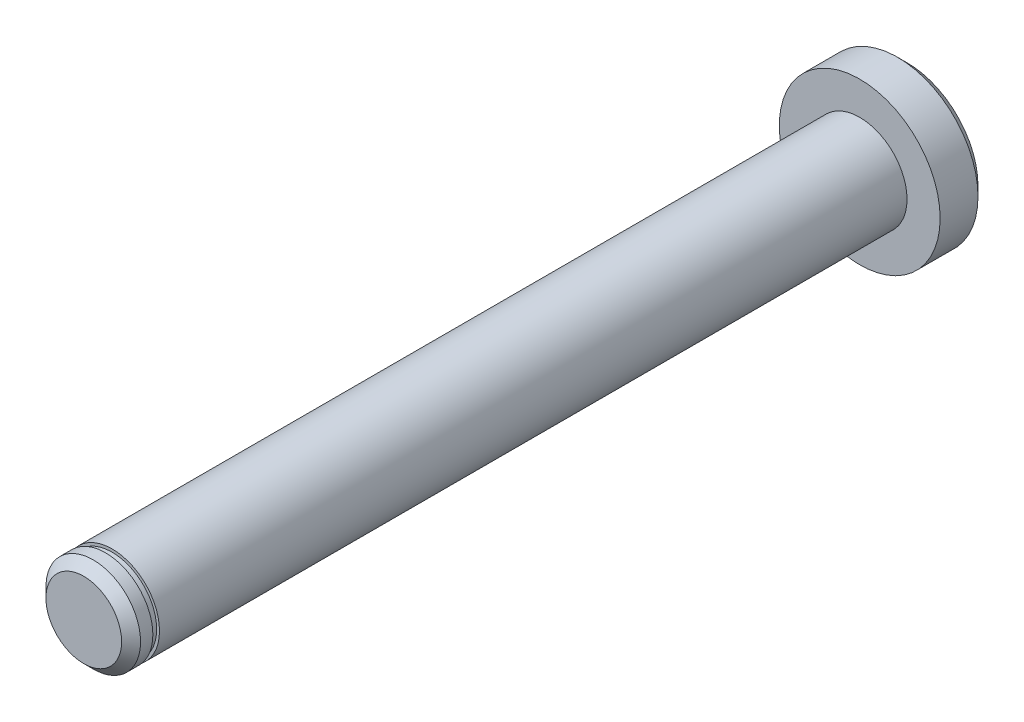
ISO-10303-21;
HEADER;
FILE_DESCRIPTION(('STEP AP214'),'2;1');
FILE_NAME('part.step','',(''),(''),'','','');
FILE_SCHEMA(('AUTOMOTIVE_DESIGN { 1 0 10303 214 1 1 1 1 }'));
ENDSEC;
DATA;
#1=APPLICATION_CONTEXT('core data for automotive mechanical design processes');
#2=APPLICATION_PROTOCOL_DEFINITION('international standard','automotive_design',2000,#1);
#3=PRODUCT_CONTEXT('',#1,'mechanical');
#4=PRODUCT('Part','Part','',(#3));
#5=PRODUCT_RELATED_PRODUCT_CATEGORY('part','',(#4));
#6=PRODUCT_DEFINITION_FORMATION('','',#4);
#7=PRODUCT_DEFINITION_CONTEXT('part definition',#1,'design');
#8=PRODUCT_DEFINITION('design','',#6,#7);
#9=PRODUCT_DEFINITION_SHAPE('','',#8);
#10=(LENGTH_UNIT() NAMED_UNIT(*) SI_UNIT(.MILLI.,.METRE.));
#11=(NAMED_UNIT(*) PLANE_ANGLE_UNIT() SI_UNIT($,.RADIAN.));
#12=(NAMED_UNIT(*) SI_UNIT($,.STERADIAN.) SOLID_ANGLE_UNIT());
#13=UNCERTAINTY_MEASURE_WITH_UNIT(LENGTH_MEASURE(1.E-05),#10,'distance_accuracy_value','');
#14=(GEOMETRIC_REPRESENTATION_CONTEXT(3) GLOBAL_UNCERTAINTY_ASSIGNED_CONTEXT((#13)) GLOBAL_UNIT_ASSIGNED_CONTEXT((#10,
#11,#12)) REPRESENTATION_CONTEXT('',''));
#15=CARTESIAN_POINT('',(0.,0.,0.));
#16=DIRECTION('',(0.,0.,1.));
#17=DIRECTION('',(1.,0.,0.));
#18=AXIS2_PLACEMENT_3D('',#15,#16,#17);
#19=CARTESIAN_POINT('',(0.,0.,87.));
#20=DIRECTION('',(0.,0.,-1.));
#21=DIRECTION('',(-1.,0.,0.));
#22=AXIS2_PLACEMENT_3D('',#19,#20,#21);
#23=CYLINDRICAL_SURFACE('',#22,5.);
#24=CARTESIAN_POINT('',(0.,0.,5.));
#25=DIRECTION('',(0.,0.,1.));
#26=DIRECTION('',(1.,0.,0.));
#27=AXIS2_PLACEMENT_3D('',#24,#25,#26);
#28=CIRCLE('',#27,5.);
#29=CARTESIAN_POINT('',(5.,0.,5.));
#30=VERTEX_POINT('',#29);
#31=EDGE_CURVE('E57',#30,#30,#28,.T.);
#32=ORIENTED_EDGE('',*,*,#31,.T.);
#33=EDGE_LOOP('',(#32));
#34=FACE_BOUND('',#33,.T.);
#35=CARTESIAN_POINT('',(0.,0.,84.));
#36=DIRECTION('',(0.,0.,1.));
#37=DIRECTION('',(1.,0.,0.));
#38=AXIS2_PLACEMENT_3D('',#35,#36,#37);
#39=CIRCLE('',#38,5.);
#40=CARTESIAN_POINT('',(5.,0.,84.));
#41=VERTEX_POINT('',#40);
#42=EDGE_CURVE('E51',#41,#41,#39,.T.);
#43=ORIENTED_EDGE('',*,*,#42,.F.);
#44=EDGE_LOOP('',(#43));
#45=FACE_BOUND('',#44,.T.);
#46=ADVANCED_FACE('F35',(#34,#45),#23,.T.);
#47=CARTESIAN_POINT('',(0.,0.,5.));
#48=DIRECTION('',(0.,0.,1.));
#49=DIRECTION('',(1.,0.,0.));
#50=AXIS2_PLACEMENT_3D('',#47,#48,#49);
#51=PLANE('',#50);
#52=CARTESIAN_POINT('',(0.,0.,5.));
#53=DIRECTION('',(0.,0.,1.));
#54=DIRECTION('',(1.,0.,0.));
#55=AXIS2_PLACEMENT_3D('',#52,#53,#54);
#56=CIRCLE('',#55,8.5);
#57=CARTESIAN_POINT('',(8.5,0.,5.));
#58=VERTEX_POINT('',#57);
#59=EDGE_CURVE('E68',#58,#58,#56,.T.);
#60=ORIENTED_EDGE('',*,*,#59,.T.);
#61=EDGE_LOOP('',(#60));
#62=FACE_BOUND('',#61,.T.);
#63=ORIENTED_EDGE('',*,*,#31,.F.);
#64=EDGE_LOOP('',(#63));
#65=FACE_BOUND('',#64,.T.);
#66=ADVANCED_FACE('F87',(#62,#65),#51,.T.);
#67=CARTESIAN_POINT('',(0.,0.,5.));
#68=DIRECTION('',(0.,0.,-1.));
#69=DIRECTION('',(-1.,0.,0.));
#70=AXIS2_PLACEMENT_3D('',#67,#68,#69);
#71=CYLINDRICAL_SURFACE('',#70,8.5);
#72=CARTESIAN_POINT('',(0.,0.,0.999999999999992));
#73=DIRECTION('',(0.,0.,1.));
#74=DIRECTION('',(1.,0.,0.));
#75=AXIS2_PLACEMENT_3D('',#72,#73,#74);
#76=CIRCLE('',#75,8.5);
#77=CARTESIAN_POINT('',(8.5,0.,0.999999999999992));
#78=VERTEX_POINT('',#77);
#79=EDGE_CURVE('E71',#78,#78,#76,.T.);
#80=ORIENTED_EDGE('',*,*,#79,.T.);
#81=EDGE_LOOP('',(#80));
#82=FACE_BOUND('',#81,.T.);
#83=ORIENTED_EDGE('',*,*,#59,.F.);
#84=EDGE_LOOP('',(#83));
#85=FACE_BOUND('',#84,.T.);
#86=ADVANCED_FACE('F84',(#82,#85),#71,.T.);
#87=CARTESIAN_POINT('',(0.,0.,0.));
#88=DIRECTION('',(0.,0.,1.));
#89=DIRECTION('',(1.,0.,0.));
#90=AXIS2_PLACEMENT_3D('',#87,#88,#89);
#91=PLANE('',#90);
#92=CARTESIAN_POINT('',(0.,0.,0.));
#93=DIRECTION('',(0.,0.,1.));
#94=DIRECTION('',(1.,0.,0.));
#95=AXIS2_PLACEMENT_3D('',#92,#93,#94);
#96=CIRCLE('',#95,7.50000000000001);
#97=CARTESIAN_POINT('',(7.50000000000001,0.,0.));
#98=VERTEX_POINT('',#97);
#99=EDGE_CURVE('E48',#98,#98,#96,.F.);
#100=ORIENTED_EDGE('',*,*,#99,.T.);
#101=EDGE_LOOP('',(#100));
#102=FACE_BOUND('',#101,.T.);
#103=ADVANCED_FACE('F76',(#102),#91,.F.);
#104=CARTESIAN_POINT('',(0.,0.,0.999999999999992));
#105=DIRECTION('',(0.,0.,1.));
#106=DIRECTION('',(1.,0.,0.));
#107=AXIS2_PLACEMENT_3D('',#104,#105,#106);
#108=CONICAL_SURFACE('',#107,8.5,0.785398163397449);
#109=ORIENTED_EDGE('',*,*,#99,.F.);
#110=EDGE_LOOP('',(#109));
#111=FACE_BOUND('',#110,.T.);
#112=ORIENTED_EDGE('',*,*,#79,.F.);
#113=EDGE_LOOP('',(#112));
#114=FACE_BOUND('',#113,.T.);
#115=ADVANCED_FACE('F78',(#111,#114),#108,.T.);
#116=CARTESIAN_POINT('',(0.,0.,84.7));
#117=DIRECTION('',(0.,0.,1.));
#118=DIRECTION('',(1.,0.,0.));
#119=AXIS2_PLACEMENT_3D('',#116,#117,#118);
#120=PLANE('',#119);
#121=CARTESIAN_POINT('',(0.,0.,84.7));
#122=DIRECTION('',(0.,0.,1.));
#123=DIRECTION('',(1.,0.,0.));
#124=AXIS2_PLACEMENT_3D('',#121,#122,#123);
#125=CIRCLE('',#124,4.7);
#126=CARTESIAN_POINT('',(4.7,0.,84.7));
#127=VERTEX_POINT('',#126);
#128=EDGE_CURVE('E53',#127,#127,#125,.T.);
#129=ORIENTED_EDGE('',*,*,#128,.T.);
#130=EDGE_LOOP('',(#129));
#131=FACE_BOUND('',#130,.T.);
#132=CARTESIAN_POINT('',(0.,0.,84.7));
#133=DIRECTION('',(0.,0.,1.));
#134=DIRECTION('',(1.,0.,0.));
#135=AXIS2_PLACEMENT_3D('',#132,#133,#134);
#136=CIRCLE('',#135,5.);
#137=CARTESIAN_POINT('',(5.,0.,84.7));
#138=VERTEX_POINT('',#137);
#139=EDGE_CURVE('E39',#138,#138,#136,.T.);
#140=ORIENTED_EDGE('',*,*,#139,.F.);
#141=EDGE_LOOP('',(#140));
#142=FACE_BOUND('',#141,.T.);
#143=ADVANCED_FACE('F81',(#131,#142),#120,.F.);
#144=CARTESIAN_POINT('',(0.,0.,84.));
#145=DIRECTION('',(0.,0.,1.));
#146=DIRECTION('',(1.,0.,0.));
#147=AXIS2_PLACEMENT_3D('',#144,#145,#146);
#148=PLANE('',#147);
#149=CARTESIAN_POINT('',(0.,0.,84.));
#150=DIRECTION('',(0.,0.,1.));
#151=DIRECTION('',(1.,0.,0.));
#152=AXIS2_PLACEMENT_3D('',#149,#150,#151);
#153=CIRCLE('',#152,4.7);
#154=CARTESIAN_POINT('',(4.7,0.,84.));
#155=VERTEX_POINT('',#154);
#156=EDGE_CURVE('E59',#155,#155,#153,.T.);
#157=ORIENTED_EDGE('',*,*,#156,.F.);
#158=EDGE_LOOP('',(#157));
#159=FACE_BOUND('',#158,.T.);
#160=ORIENTED_EDGE('',*,*,#42,.T.);
#161=EDGE_LOOP('',(#160));
#162=FACE_BOUND('',#161,.T.);
#163=ADVANCED_FACE('F113',(#159,#162),#148,.T.);
#164=CARTESIAN_POINT('',(0.,0.,84.7));
#165=DIRECTION('',(0.,0.,-1.));
#166=DIRECTION('',(-1.,0.,0.));
#167=AXIS2_PLACEMENT_3D('',#164,#165,#166);
#168=CYLINDRICAL_SURFACE('',#167,4.7);
#169=ORIENTED_EDGE('',*,*,#128,.F.);
#170=EDGE_LOOP('',(#169));
#171=FACE_BOUND('',#170,.T.);
#172=ORIENTED_EDGE('',*,*,#156,.T.);
#173=EDGE_LOOP('',(#172));
#174=FACE_BOUND('',#173,.T.);
#175=ADVANCED_FACE('F118',(#171,#174),#168,.T.);
#176=CARTESIAN_POINT('',(0.,0.,87.));
#177=DIRECTION('',(0.,0.,1.));
#178=DIRECTION('',(1.,0.,0.));
#179=AXIS2_PLACEMENT_3D('',#176,#177,#178);
#180=PLANE('',#179);
#181=CARTESIAN_POINT('',(0.,0.,87.));
#182=DIRECTION('',(0.,0.,1.));
#183=DIRECTION('',(1.,0.,0.));
#184=AXIS2_PLACEMENT_3D('',#181,#182,#183);
#185=CIRCLE('',#184,3.99999999999999);
#186=CARTESIAN_POINT('',(3.99999999999999,0.,87.));
#187=VERTEX_POINT('',#186);
#188=EDGE_CURVE('E43',#187,#187,#185,.T.);
#189=ORIENTED_EDGE('',*,*,#188,.T.);
#190=EDGE_LOOP('',(#189));
#191=FACE_BOUND('',#190,.T.);
#192=ADVANCED_FACE('F108',(#191),#180,.T.);
#193=CARTESIAN_POINT('',(0.,0.,87.));
#194=DIRECTION('',(0.,0.,-1.));
#195=DIRECTION('',(-1.,0.,0.));
#196=AXIS2_PLACEMENT_3D('',#193,#194,#195);
#197=CONICAL_SURFACE('',#196,3.99999999999999,0.785398163397446);
#198=CARTESIAN_POINT('',(0.,0.,86.));
#199=DIRECTION('',(0.,0.,1.));
#200=DIRECTION('',(1.,0.,0.));
#201=AXIS2_PLACEMENT_3D('',#198,#199,#200);
#202=CIRCLE('',#201,5.);
#203=CARTESIAN_POINT('',(5.,0.,86.));
#204=VERTEX_POINT('',#203);
#205=EDGE_CURVE('E11',#204,#204,#202,.F.);
#206=ORIENTED_EDGE('',*,*,#205,.F.);
#207=EDGE_LOOP('',(#206));
#208=FACE_BOUND('',#207,.T.);
#209=ORIENTED_EDGE('',*,*,#188,.F.);
#210=EDGE_LOOP('',(#209));
#211=FACE_BOUND('',#210,.T.);
#212=ADVANCED_FACE('F37',(#208,#211),#197,.T.);
#213=ORIENTED_EDGE('',*,*,#139,.T.);
#214=EDGE_LOOP('',(#213));
#215=FACE_BOUND('',#214,.T.);
#216=ORIENTED_EDGE('',*,*,#205,.T.);
#217=EDGE_LOOP('',(#216));
#218=FACE_BOUND('',#217,.T.);
#219=ADVANCED_FACE('F99',(#215,#218),#23,.T.);
#220=CLOSED_SHELL('',(#46,#66,#86,#103,#115,#143,#163,#175,#192,#212,#219));
#221=MANIFOLD_SOLID_BREP('B2',#220);
#222=ADVANCED_BREP_SHAPE_REPRESENTATION('',(#18,#221),#14);
#223=SHAPE_DEFINITION_REPRESENTATION(#9,#222);
ENDSEC;
END-ISO-10303-21;
